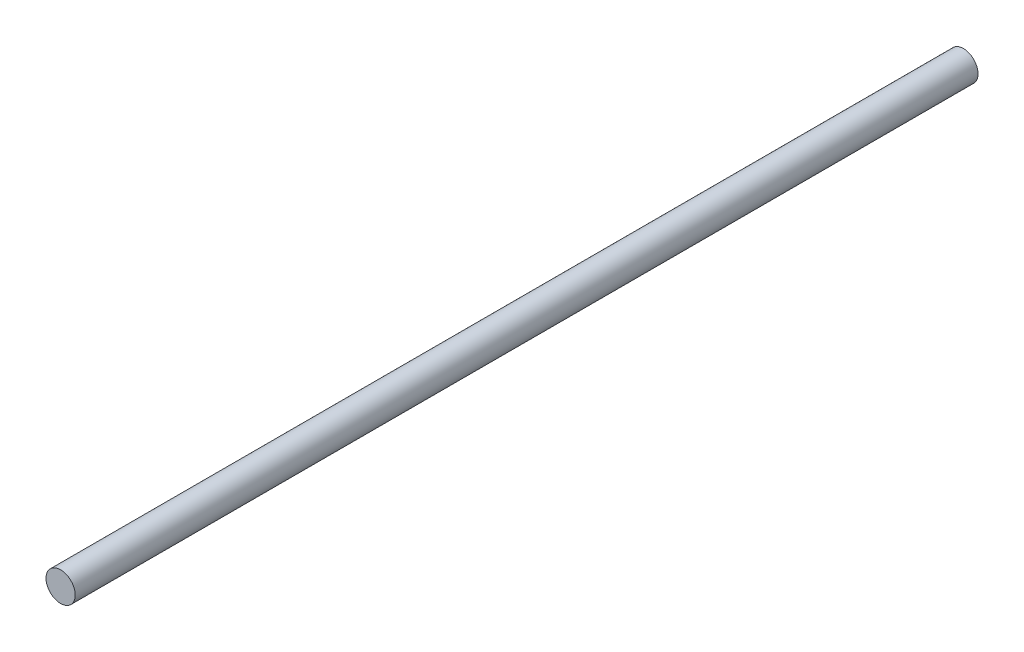
ISO-10303-21;
HEADER;
FILE_DESCRIPTION(('STEP AP214'),'2;1');
FILE_NAME('part.step','',(''),(''),'','','');
FILE_SCHEMA(('AUTOMOTIVE_DESIGN { 1 0 10303 214 1 1 1 1 }'));
ENDSEC;
DATA;
#1=APPLICATION_CONTEXT('core data for automotive mechanical design processes');
#2=APPLICATION_PROTOCOL_DEFINITION('international standard','automotive_design',2000,#1);
#3=PRODUCT_CONTEXT('',#1,'mechanical');
#4=PRODUCT('Part','Part','',(#3));
#5=PRODUCT_RELATED_PRODUCT_CATEGORY('part','',(#4));
#6=PRODUCT_DEFINITION_FORMATION('','',#4);
#7=PRODUCT_DEFINITION_CONTEXT('part definition',#1,'design');
#8=PRODUCT_DEFINITION('design','',#6,#7);
#9=PRODUCT_DEFINITION_SHAPE('','',#8);
#10=(LENGTH_UNIT() NAMED_UNIT(*) SI_UNIT(.MILLI.,.METRE.));
#11=(NAMED_UNIT(*) PLANE_ANGLE_UNIT() SI_UNIT($,.RADIAN.));
#12=(NAMED_UNIT(*) SI_UNIT($,.STERADIAN.) SOLID_ANGLE_UNIT());
#13=UNCERTAINTY_MEASURE_WITH_UNIT(LENGTH_MEASURE(1.E-05),#10,'distance_accuracy_value','');
#14=(GEOMETRIC_REPRESENTATION_CONTEXT(3) GLOBAL_UNCERTAINTY_ASSIGNED_CONTEXT((#13)) GLOBAL_UNIT_ASSIGNED_CONTEXT((#10,
#11,#12)) REPRESENTATION_CONTEXT('',''));
#15=CARTESIAN_POINT('',(0.,0.,0.));
#16=DIRECTION('',(0.,0.,1.));
#17=DIRECTION('',(1.,0.,0.));
#18=AXIS2_PLACEMENT_3D('',#15,#16,#17);
#19=CARTESIAN_POINT('',(0.,0.,86.));
#20=DIRECTION('',(0.,0.,-1.));
#21=DIRECTION('',(-1.,0.,0.));
#22=AXIS2_PLACEMENT_3D('',#19,#20,#21);
#23=CYLINDRICAL_SURFACE('',#22,2.2);
#24=CARTESIAN_POINT('',(0.,0.,86.));
#25=DIRECTION('',(0.,0.,-1.));
#26=DIRECTION('',(-1.,0.,0.));
#27=AXIS2_PLACEMENT_3D('',#24,#25,#26);
#28=CIRCLE('',#27,2.2);
#29=CARTESIAN_POINT('',(-2.2,0.,86.));
#30=VERTEX_POINT('',#29);
#31=EDGE_CURVE('E10',#30,#30,#28,.T.);
#32=ORIENTED_EDGE('',*,*,#31,.T.);
#33=EDGE_LOOP('',(#32));
#34=FACE_BOUND('',#33,.T.);
#35=CARTESIAN_POINT('',(0.,0.,-50.));
#36=DIRECTION('',(0.,0.,-1.));
#37=DIRECTION('',(-1.,0.,0.));
#38=AXIS2_PLACEMENT_3D('',#35,#36,#37);
#39=CIRCLE('',#38,2.2);
#40=CARTESIAN_POINT('',(-2.2,0.,-50.));
#41=VERTEX_POINT('',#40);
#42=EDGE_CURVE('E36',#41,#41,#39,.T.);
#43=ORIENTED_EDGE('',*,*,#42,.F.);
#44=EDGE_LOOP('',(#43));
#45=FACE_BOUND('',#44,.T.);
#46=ADVANCED_FACE('F30',(#34,#45),#23,.T.);
#47=CARTESIAN_POINT('',(0.,0.,86.));
#48=DIRECTION('',(0.,0.,-1.));
#49=DIRECTION('',(-1.,0.,0.));
#50=AXIS2_PLACEMENT_3D('',#47,#48,#49);
#51=PLANE('',#50);
#52=ORIENTED_EDGE('',*,*,#31,.F.);
#53=EDGE_LOOP('',(#52));
#54=FACE_BOUND('',#53,.T.);
#55=ADVANCED_FACE('F45',(#54),#51,.F.);
#56=CARTESIAN_POINT('',(0.,0.,-50.));
#57=DIRECTION('',(0.,0.,-1.));
#58=DIRECTION('',(-1.,0.,0.));
#59=AXIS2_PLACEMENT_3D('',#56,#57,#58);
#60=PLANE('',#59);
#61=ORIENTED_EDGE('',*,*,#42,.T.);
#62=EDGE_LOOP('',(#61));
#63=FACE_BOUND('',#62,.T.);
#64=ADVANCED_FACE('F42',(#63),#60,.T.);
#65=CLOSED_SHELL('',(#46,#55,#64));
#66=MANIFOLD_SOLID_BREP('B2',#65);
#67=ADVANCED_BREP_SHAPE_REPRESENTATION('',(#18,#66),#14);
#68=SHAPE_DEFINITION_REPRESENTATION(#9,#67);
ENDSEC;
END-ISO-10303-21;
